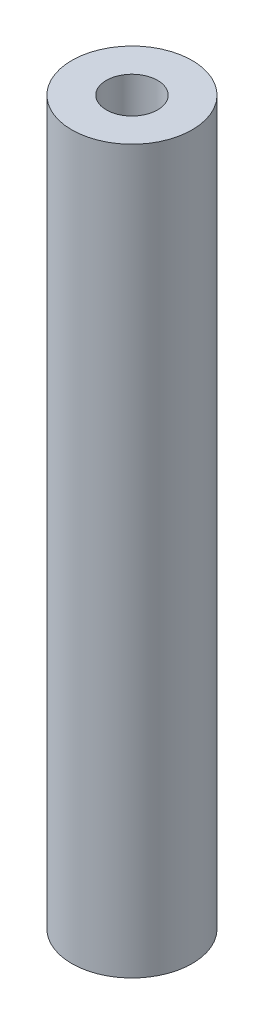
ISO-10303-21;
HEADER;
FILE_DESCRIPTION(('STEP AP214'),'2;1');
FILE_NAME('part.step','',(''),(''),'','','');
FILE_SCHEMA(('AUTOMOTIVE_DESIGN { 1 0 10303 214 1 1 1 1 }'));
ENDSEC;
DATA;
#1=APPLICATION_CONTEXT('core data for automotive mechanical design processes');
#2=APPLICATION_PROTOCOL_DEFINITION('international standard','automotive_design',2000,#1);
#3=PRODUCT_CONTEXT('',#1,'mechanical');
#4=PRODUCT('Part','Part','',(#3));
#5=PRODUCT_RELATED_PRODUCT_CATEGORY('part','',(#4));
#6=PRODUCT_DEFINITION_FORMATION('','',#4);
#7=PRODUCT_DEFINITION_CONTEXT('part definition',#1,'design');
#8=PRODUCT_DEFINITION('design','',#6,#7);
#9=PRODUCT_DEFINITION_SHAPE('','',#8);
#10=(LENGTH_UNIT() NAMED_UNIT(*) SI_UNIT(.MILLI.,.METRE.));
#11=(NAMED_UNIT(*) PLANE_ANGLE_UNIT() SI_UNIT($,.RADIAN.));
#12=(NAMED_UNIT(*) SI_UNIT($,.STERADIAN.) SOLID_ANGLE_UNIT());
#13=UNCERTAINTY_MEASURE_WITH_UNIT(LENGTH_MEASURE(1.E-05),#10,'distance_accuracy_value','');
#14=(GEOMETRIC_REPRESENTATION_CONTEXT(3) GLOBAL_UNCERTAINTY_ASSIGNED_CONTEXT((#13)) GLOBAL_UNIT_ASSIGNED_CONTEXT((#10,
#11,#12)) REPRESENTATION_CONTEXT('',''));
#15=CARTESIAN_POINT('',(0.,0.,0.));
#16=DIRECTION('',(0.,0.,1.));
#17=DIRECTION('',(1.,0.,0.));
#18=AXIS2_PLACEMENT_3D('',#15,#16,#17);
#19=CARTESIAN_POINT('',(0.,38.1,0.));
#20=DIRECTION('',(0.,-1.,0.));
#21=DIRECTION('',(0.,0.,-1.));
#22=AXIS2_PLACEMENT_3D('',#19,#20,#21);
#23=CYLINDRICAL_SURFACE('',#22,3.175);
#24=CARTESIAN_POINT('',(0.,38.1,0.));
#25=DIRECTION('',(0.,1.,0.));
#26=DIRECTION('',(0.,0.,1.));
#27=AXIS2_PLACEMENT_3D('',#24,#25,#26);
#28=CIRCLE('',#27,3.175);
#29=CARTESIAN_POINT('',(0.,38.1,3.175));
#30=VERTEX_POINT('',#29);
#31=EDGE_CURVE('E10',#30,#30,#28,.T.);
#32=ORIENTED_EDGE('',*,*,#31,.F.);
#33=EDGE_LOOP('',(#32));
#34=FACE_BOUND('',#33,.T.);
#35=CARTESIAN_POINT('',(0.,0.,0.));
#36=DIRECTION('',(0.,1.,0.));
#37=DIRECTION('',(0.,0.,1.));
#38=AXIS2_PLACEMENT_3D('',#35,#36,#37);
#39=CIRCLE('',#38,3.175);
#40=CARTESIAN_POINT('',(0.,0.,3.175));
#41=VERTEX_POINT('',#40);
#42=EDGE_CURVE('E34',#41,#41,#39,.T.);
#43=ORIENTED_EDGE('',*,*,#42,.T.);
#44=EDGE_LOOP('',(#43));
#45=FACE_BOUND('',#44,.T.);
#46=ADVANCED_FACE('F31',(#34,#45),#23,.T.);
#47=CARTESIAN_POINT('',(0.,38.1,0.));
#48=DIRECTION('',(0.,1.,0.));
#49=DIRECTION('',(0.,0.,1.));
#50=AXIS2_PLACEMENT_3D('',#47,#48,#49);
#51=PLANE('',#50);
#52=CARTESIAN_POINT('',(0.,38.1,0.));
#53=DIRECTION('',(0.,1.,0.));
#54=DIRECTION('',(0.,0.,1.));
#55=AXIS2_PLACEMENT_3D('',#52,#53,#54);
#56=CIRCLE('',#55,1.35254999999999);
#57=CARTESIAN_POINT('',(0.,38.1,1.35254999999999));
#58=VERTEX_POINT('',#57);
#59=EDGE_CURVE('E45',#58,#58,#56,.T.);
#60=ORIENTED_EDGE('',*,*,#59,.F.);
#61=EDGE_LOOP('',(#60));
#62=FACE_BOUND('',#61,.T.);
#63=ORIENTED_EDGE('',*,*,#31,.T.);
#64=EDGE_LOOP('',(#63));
#65=FACE_BOUND('',#64,.T.);
#66=ADVANCED_FACE('F51',(#62,#65),#51,.T.);
#67=CARTESIAN_POINT('',(0.,0.,0.));
#68=DIRECTION('',(0.,1.,0.));
#69=DIRECTION('',(0.,0.,1.));
#70=AXIS2_PLACEMENT_3D('',#67,#68,#69);
#71=PLANE('',#70);
#72=CARTESIAN_POINT('',(0.,0.,0.));
#73=DIRECTION('',(0.,1.,0.));
#74=DIRECTION('',(0.,0.,1.));
#75=AXIS2_PLACEMENT_3D('',#72,#73,#74);
#76=CIRCLE('',#75,1.35254999999999);
#77=CARTESIAN_POINT('',(0.,0.,1.35254999999999));
#78=VERTEX_POINT('',#77);
#79=EDGE_CURVE('E41',#78,#78,#76,.T.);
#80=ORIENTED_EDGE('',*,*,#79,.T.);
#81=EDGE_LOOP('',(#80));
#82=FACE_BOUND('',#81,.T.);
#83=ORIENTED_EDGE('',*,*,#42,.F.);
#84=EDGE_LOOP('',(#83));
#85=FACE_BOUND('',#84,.T.);
#86=ADVANCED_FACE('F53',(#82,#85),#71,.F.);
#87=CARTESIAN_POINT('',(0.,38.1,0.));
#88=DIRECTION('',(0.,1.,0.));
#89=DIRECTION('',(0.,0.,1.));
#90=AXIS2_PLACEMENT_3D('',#87,#88,#89);
#91=CYLINDRICAL_SURFACE('',#90,1.35254999999999);
#92=ORIENTED_EDGE('',*,*,#79,.F.);
#93=EDGE_LOOP('',(#92));
#94=FACE_BOUND('',#93,.T.);
#95=ORIENTED_EDGE('',*,*,#59,.T.);
#96=EDGE_LOOP('',(#95));
#97=FACE_BOUND('',#96,.T.);
#98=ADVANCED_FACE('F49',(#94,#97),#91,.F.);
#99=CLOSED_SHELL('',(#46,#66,#86,#98));
#100=MANIFOLD_SOLID_BREP('B2',#99);
#101=ADVANCED_BREP_SHAPE_REPRESENTATION('',(#18,#100),#14);
#102=SHAPE_DEFINITION_REPRESENTATION(#9,#101);
ENDSEC;
END-ISO-10303-21;
